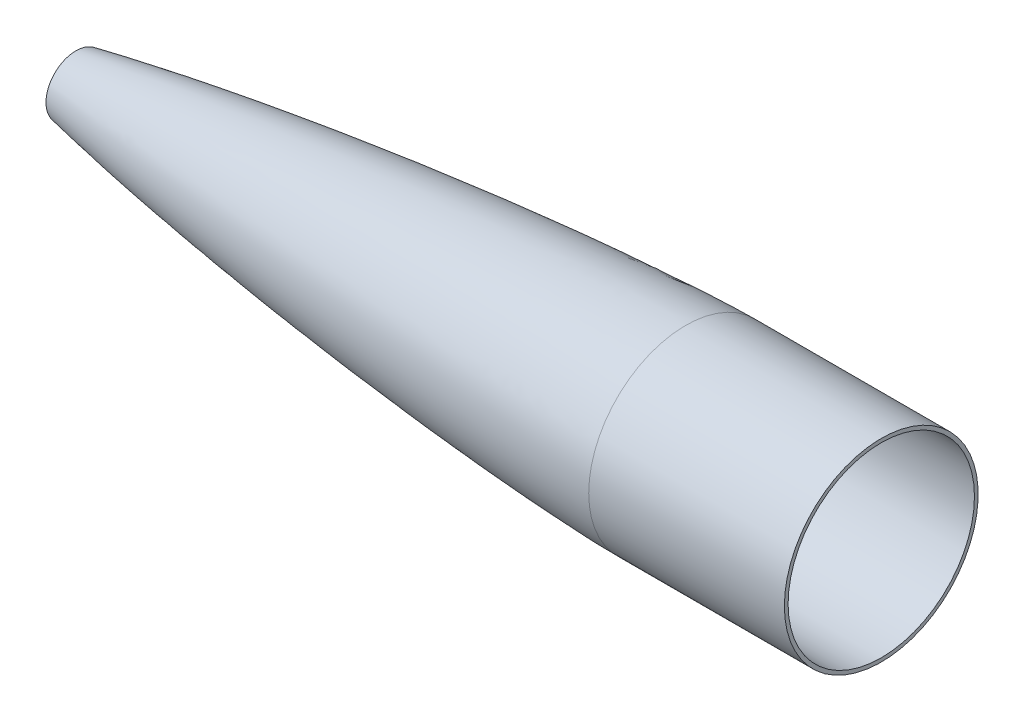
ISO-10303-21;
HEADER;
FILE_DESCRIPTION(('STEP AP214'),'2;1');
FILE_NAME('part.step','',(''),(''),'','','');
FILE_SCHEMA(('AUTOMOTIVE_DESIGN { 1 0 10303 214 1 1 1 1 }'));
ENDSEC;
DATA;
#1=APPLICATION_CONTEXT('core data for automotive mechanical design processes');
#2=APPLICATION_PROTOCOL_DEFINITION('international standard','automotive_design',2000,#1);
#3=PRODUCT_CONTEXT('',#1,'mechanical');
#4=PRODUCT('Part','Part','',(#3));
#5=PRODUCT_RELATED_PRODUCT_CATEGORY('part','',(#4));
#6=PRODUCT_DEFINITION_FORMATION('','',#4);
#7=PRODUCT_DEFINITION_CONTEXT('part definition',#1,'design');
#8=PRODUCT_DEFINITION('design','',#6,#7);
#9=PRODUCT_DEFINITION_SHAPE('','',#8);
#10=(LENGTH_UNIT() NAMED_UNIT(*) SI_UNIT(.MILLI.,.METRE.));
#11=(NAMED_UNIT(*) PLANE_ANGLE_UNIT() SI_UNIT($,.RADIAN.));
#12=(NAMED_UNIT(*) SI_UNIT($,.STERADIAN.) SOLID_ANGLE_UNIT());
#13=UNCERTAINTY_MEASURE_WITH_UNIT(LENGTH_MEASURE(1.E-05),#10,'distance_accuracy_value','');
#14=(GEOMETRIC_REPRESENTATION_CONTEXT(3) GLOBAL_UNCERTAINTY_ASSIGNED_CONTEXT((#13)) GLOBAL_UNIT_ASSIGNED_CONTEXT((#10,
#11,#12)) REPRESENTATION_CONTEXT('',''));
#15=CARTESIAN_POINT('',(0.,0.,0.));
#16=DIRECTION('',(0.,0.,1.));
#17=DIRECTION('',(1.,0.,0.));
#18=AXIS2_PLACEMENT_3D('',#15,#16,#17);
#19=CARTESIAN_POINT('',(-19.05,0.,0.));
#20=DIRECTION('',(-1.,0.,0.));
#21=DIRECTION('',(0.,0.,1.));
#22=AXIS2_PLACEMENT_3D('',#19,#20,#21);
#23=CYLINDRICAL_SURFACE('',#22,39.7256);
#24=CARTESIAN_POINT('',(294.4368,0.,0.));
#25=DIRECTION('',(-1.,0.,0.));
#26=DIRECTION('',(0.,0.,1.));
#27=AXIS2_PLACEMENT_3D('',#24,#25,#26);
#28=CIRCLE('',#27,39.7256);
#29=CARTESIAN_POINT('',(294.4368,0.,39.7256));
#30=VERTEX_POINT('',#29);
#31=EDGE_CURVE('E10',#30,#30,#28,.T.);
#32=ORIENTED_EDGE('',*,*,#31,.F.);
#33=EDGE_LOOP('',(#32));
#34=FACE_BOUND('',#33,.T.);
#35=CARTESIAN_POINT('',(374.650064344496,0.,0.));
#36=DIRECTION('',(-1.,0.,0.));
#37=DIRECTION('',(0.,0.,1.));
#38=AXIS2_PLACEMENT_3D('',#35,#36,#37);
#39=CIRCLE('',#38,39.7256);
#40=CARTESIAN_POINT('',(374.650064344496,0.,39.7256));
#41=VERTEX_POINT('',#40);
#42=EDGE_CURVE('E41',#41,#41,#39,.T.);
#43=ORIENTED_EDGE('',*,*,#42,.T.);
#44=EDGE_LOOP('',(#43));
#45=FACE_BOUND('',#44,.T.);
#46=ADVANCED_FACE('F34',(#34,#45),#23,.T.);
#47=CARTESIAN_POINT('',(294.4368,39.7256,0.));
#48=CARTESIAN_POINT('',(293.538264936894,39.7227781703544,0.));
#49=CARTESIAN_POINT('',(291.741303803302,39.7002039400171,0.));
#50=CARTESIAN_POINT('',(288.147806256193,39.6307016879067,0.));
#51=CARTESIAN_POINT('',(279.918815613173,39.3889822589623,0.));
#52=CARTESIAN_POINT('',(267.957235485054,38.8762226570791,0.));
#53=CARTESIAN_POINT('',(252.269921818901,37.9897310289716,0.));
#54=CARTESIAN_POINT('',(233.761451080803,36.6987300745286,0.));
#55=CARTESIAN_POINT('',(215.268686952188,35.200969595861,0.));
#56=CARTESIAN_POINT('',(196.792047007808,33.5162401971686,0.));
#57=CARTESIAN_POINT('',(178.332324198228,31.6557055301637,0.));
#58=CARTESIAN_POINT('',(159.890639304378,29.6240021598707,0.));
#59=CARTESIAN_POINT('',(141.468704528161,27.4205610926059,0.));
#60=CARTESIAN_POINT('',(123.068739671915,25.0400732746453,0.));
#61=CARTESIAN_POINT('',(104.694212708318,22.4706963349108,0.));
#62=CARTESIAN_POINT('',(86.3496826980187,19.6939502091708,0.));
#63=CARTESIAN_POINT('',(68.0430622365847,16.6772648540575,0.));
#64=CARTESIAN_POINT('',(49.818424698582,13.3765223021058,0.));
#65=CARTESIAN_POINT('',(33.9406856398122,10.1498634465492,0.));
#66=CARTESIAN_POINT('',(21.1447927754208,7.19091792425048,0.));
#67=CARTESIAN_POINT('',(12.0854389700209,4.74376046507185,0.));
#68=CARTESIAN_POINT('',(7.05576322628537,3.17959978307188,0.));
#69=CARTESIAN_POINT('',(4.0188012304067,2.08676764385367,0.));
#70=CARTESIAN_POINT('',(2.33371074508546,1.38731323839093,0.));
#71=CARTESIAN_POINT('',(1.40388432372297,0.947026682290267,0.));
#72=CARTESIAN_POINT('',(0.87209723308368,0.661946371557733,0.));
#73=CARTESIAN_POINT('',(0.556889445492457,0.472533954344698,0.));
#74=CARTESIAN_POINT('',(0.370605462423568,0.347964982562249,0.));
#75=CARTESIAN_POINT('',(0.248450567810074,0.257670761882754,0.));
#76=CARTESIAN_POINT('',(0.159992101765354,0.185526094257961,0.));
#77=CARTESIAN_POINT('',(0.0986367195289148,0.129934350685668,0.));
#78=CARTESIAN_POINT('',(0.0520006916757201,0.0813137653612726,0.));
#79=CARTESIAN_POINT('',(0.0201829235935841,0.0404052506099982,0.));
#80=CARTESIAN_POINT('',(0.00657570245071043,0.0182498433560136,0.));
#81=CARTESIAN_POINT('',(0.00185773297492475,0.0062340322543729,0.));
#82=CARTESIAN_POINT('',(0.,0.,0.));
#83=B_SPLINE_CURVE_WITH_KNOTS('',4,(#47,#48,#49,#50,#51,#52,#53,#54,#55,#56,#57,#58,#59,#60,#61,
#62,#63,#64,#65,#66,#67,#68,#69,#70,#71,#72,#73,#74,#75,#76,#77,#78,#79,#80,#81,#82),
.UNSPECIFIED.,.F.,.F.,(5,1,1,1,1,1,1,1,1,1,1,1,1,1,1,1,1,1,1,1,1,1,1,1,1,1,1,1,1,1,1,1,5),(0.,
0.0120599701125952,0.0241199402251903,0.0482398804503805,0.1104935820596,0.172747283844769,
0.235000984013769,0.297254686823773,0.359508386221387,0.421762088339113,0.484015788959948,
0.546269489090148,0.60852319021114,0.670776891466794,0.733030591698496,0.795284289783134,
0.857537990172938,0.919348906793277,0.95047573101264,0.971525230460581,0.983463902787434,
0.99002606304966,0.993781479893161,0.996003962640871,0.997267165840399,0.998121150964244,
0.998715599634537,0.999010469110389,0.999305338586241,0.99965266929312,0.99982633464656,
0.99991316732328,1.),.UNSPECIFIED.);
#84=CARTESIAN_POINT('',(-19.05,0.,0.));
#85=DIRECTION('',(-1.,0.,0.));
#86=AXIS1_PLACEMENT('',#84,#85);
#87=SURFACE_OF_REVOLUTION('',#83,#86);
#88=CARTESIAN_POINT('',(44.4500643444959,0.,0.));
#89=DIRECTION('',(-1.,0.,0.));
#90=DIRECTION('',(0.,0.,1.));
#91=AXIS2_PLACEMENT_3D('',#88,#89,#90);
#92=CIRCLE('',#91,12.2403045277828);
#93=CARTESIAN_POINT('',(44.4500643444959,0.,12.2403045277828));
#94=VERTEX_POINT('',#93);
#95=EDGE_CURVE('E153',#94,#94,#92,.F.);
#96=ORIENTED_EDGE('',*,*,#95,.T.);
#97=EDGE_LOOP('',(#96));
#98=FACE_BOUND('',#97,.T.);
#99=ORIENTED_EDGE('',*,*,#31,.T.);
#100=EDGE_LOOP('',(#99));
#101=FACE_BOUND('',#100,.T.);
#102=ADVANCED_FACE('F57',(#98,#101),#87,.T.);
#103=CARTESIAN_POINT('',(374.650064344496,0.,0.));
#104=DIRECTION('',(-1.,0.,0.));
#105=DIRECTION('',(0.,0.,1.));
#106=AXIS2_PLACEMENT_3D('',#103,#104,#105);
#107=PLANE('',#106);
#108=CARTESIAN_POINT('',(374.650064344496,0.,0.));
#109=DIRECTION('',(-1.,0.,0.));
#110=DIRECTION('',(0.,0.,1.));
#111=AXIS2_PLACEMENT_3D('',#108,#109,#110);
#112=CIRCLE('',#111,38.2016);
#113=CARTESIAN_POINT('',(374.650064344496,0.,38.2016));
#114=VERTEX_POINT('',#113);
#115=EDGE_CURVE('E52',#114,#114,#112,.T.);
#116=ORIENTED_EDGE('',*,*,#115,.T.);
#117=EDGE_LOOP('',(#116));
#118=FACE_BOUND('',#117,.T.);
#119=ORIENTED_EDGE('',*,*,#42,.F.);
#120=EDGE_LOOP('',(#119));
#121=FACE_BOUND('',#120,.T.);
#122=ADVANCED_FACE('F60',(#118,#121),#107,.F.);
#123=CARTESIAN_POINT('',(-19.05,0.,0.));
#124=DIRECTION('',(-1.,0.,0.));
#125=DIRECTION('',(0.,0.,1.));
#126=AXIS2_PLACEMENT_3D('',#123,#124,#125);
#127=CYLINDRICAL_SURFACE('',#126,38.2016);
#128=CARTESIAN_POINT('',(294.441586064899,0.,38.2016075152473));
#129=CARTESIAN_POINT('',(294.441586064891,-0.625072972520353,38.2016207745964));
#130=CARTESIAN_POINT('',(294.441586064892,-1.25014481680002,38.1862664038765));
#131=CARTESIAN_POINT('',(294.441586064899,-2.49878325596288,38.1249176080443));
#132=CARTESIAN_POINT('',(294.441586064904,-3.12234985084618,38.0789231829345));
#133=CARTESIAN_POINT('',(294.441586064905,-4.36647479842312,37.9563894840658));
#134=CARTESIAN_POINT('',(294.441586064901,-4.98703315111663,37.8798502103057));
#135=CARTESIAN_POINT('',(294.441586064898,-6.22364684018645,37.6964153836531));
#136=CARTESIAN_POINT('',(294.4415860649,-6.83970217656285,37.5895198307611));
#137=CARTESIAN_POINT('',(294.441586064906,-8.06582564670876,37.3456288466498));
#138=CARTESIAN_POINT('',(294.44158606491,-8.67589378047843,37.2086334154311));
#139=CARTESIAN_POINT('',(294.441586064911,-9.88857315263689,36.9048730087374));
#140=CARTESIAN_POINT('',(294.441586064908,-10.4911843910252,36.7381080332605));
#141=CARTESIAN_POINT('',(294.441586064903,-11.6874982251756,36.3752102090804));
#142=CARTESIAN_POINT('',(294.441586064901,-12.2812008209376,36.1790773603773));
#143=CARTESIAN_POINT('',(294.44158606489,-13.4582670893082,35.7579163125127));
#144=CARTESIAN_POINT('',(294.441586064881,-14.0416307619172,35.5328881133528));
#145=CARTESIAN_POINT('',(294.441586064886,-15.1966138095815,35.0544784714208));
#146=CARTESIAN_POINT('',(294.441586064899,-15.7682331846361,34.801097028647));
#147=CARTESIAN_POINT('',(294.44158606491,-16.8983505561088,34.2665913191246));
#148=CARTESIAN_POINT('',(294.441586064906,-17.4568485525265,33.9854670523749));
#149=CARTESIAN_POINT('',(294.441586064901,-18.559377696023,33.3961529475129));
#150=CARTESIAN_POINT('',(294.4415860649,-19.1034088431036,33.0879631094038));
#151=CARTESIAN_POINT('',(294.441586064901,-20.1756936693301,32.4452603182113));
#152=CARTESIAN_POINT('',(294.441586064904,-20.7039473484756,32.1107473651272));
#153=CARTESIAN_POINT('',(294.441586064905,-21.7434046294472,31.4162042149567));
#154=CARTESIAN_POINT('',(294.441586064904,-22.2546082312729,31.0561740178697));
#155=CARTESIAN_POINT('',(294.441586064905,-23.2587338233481,30.3114637239814));
#156=CARTESIAN_POINT('',(294.441586064907,-23.7516558135973,29.9267836271797));
#157=CARTESIAN_POINT('',(294.441586064905,-24.7180306902463,29.1337002619244));
#158=CARTESIAN_POINT('',(294.441586064902,-25.1914835766467,28.7252969934715));
#159=CARTESIAN_POINT('',(294.4415860649,-26.1177796561554,27.8857511641365));
#160=CARTESIAN_POINT('',(294.441586064901,-26.5706228492631,27.4546086032536));
#161=CARTESIAN_POINT('',(294.441586064902,-27.4546086032431,26.5706228492736));
#162=CARTESIAN_POINT('',(294.441586064904,-27.885751164116,26.117779656177));
#163=CARTESIAN_POINT('',(294.4415860649,-28.725296993452,25.1914835766693));
#164=CARTESIAN_POINT('',(294.441586064895,-29.1337002619148,24.7180306902578));
#165=CARTESIAN_POINT('',(294.441586064892,-29.9267836271488,23.751655813635));
#166=CARTESIAN_POINT('',(294.441586064893,-30.3114637239217,23.2587338234251));
#167=CARTESIAN_POINT('',(294.441586064897,-31.0561740178129,22.2546082313528));
#168=CARTESIAN_POINT('',(294.441586064899,-31.4162042149278,21.7434046294877));
#169=CARTESIAN_POINT('',(294.4415860649,-32.1107473651354,20.7039473484662));
#170=CARTESIAN_POINT('',(294.441586064898,-32.4452603182303,20.1756936693111));
#171=CARTESIAN_POINT('',(294.441586064894,-33.0879631094284,19.1034088430499));
#172=CARTESIAN_POINT('',(294.44158606489,-33.3961529475315,18.5593776959436));
#173=CARTESIAN_POINT('',(294.441586064886,-33.9854670524354,17.4568485524578));
#174=CARTESIAN_POINT('',(294.441586064885,-34.2665913192357,16.8983505560781));
#175=CARTESIAN_POINT('',(294.441586064892,-34.801097028535,15.7682331846684));
#176=CARTESIAN_POINT('',(294.441586064901,-35.0544784710353,15.1966138096391));
#177=CARTESIAN_POINT('',(294.441586064902,-35.5328881136757,14.041630762011));
#178=CARTESIAN_POINT('',(294.441586064895,-35.7579163138138,13.4582670894113));
#179=CARTESIAN_POINT('',(294.441586064897,-36.1790773590613,12.281200820876));
#180=CARTESIAN_POINT('',(294.441586064906,-36.3752102041712,11.6874982249406));
#181=CARTESIAN_POINT('',(294.441586064905,-36.7381080381535,10.4911843913137));
#182=CARTESIAN_POINT('',(294.441586064894,-36.9048730270277,9.88857315362268));
#183=CARTESIAN_POINT('',(294.441586064893,-37.2086333970878,8.67589377970386));
#184=CARTESIAN_POINT('',(294.441586064902,-37.3456287782738,8.06582564347604));
#185=CARTESIAN_POINT('',(294.441586064905,-37.5895198990956,6.83970218000428));
#186=CARTESIAN_POINT('',(294.441586064899,-37.6964156387287,6.22364685275981));
#187=CARTESIAN_POINT('',(294.441586064899,-37.8798499552237,4.98703313858579));
#188=CARTESIAN_POINT('',(294.441586064905,-37.9563885320872,4.36647475165647));
#189=CARTESIAN_POINT('',(294.441586064904,-38.0789241349129,3.12234989761487));
#190=CARTESIAN_POINT('',(294.441586064896,-38.1249211608762,2.49878343050271));
#191=CARTESIAN_POINT('',(294.441586064894,-38.1862628510446,1.25014464226043));
#192=CARTESIAN_POINT('',(294.441586064899,-38.2016075152473,0.625072321130206));
#193=CARTESIAN_POINT('',(294.441586064899,-38.2016075152473,-0.625072321130239));
#194=CARTESIAN_POINT('',(294.441586064894,-38.1862628510446,-1.25014464226046));
#195=CARTESIAN_POINT('',(294.441586064896,-38.1249211608762,-2.49878343050245));
#196=CARTESIAN_POINT('',(294.441586064904,-38.0789241349129,-3.12234989761433));
#197=CARTESIAN_POINT('',(294.441586064905,-37.9563885320831,-4.36647475169881));
#198=CARTESIAN_POINT('',(294.4415860649,-37.8798499552132,-4.98703313867107));
#199=CARTESIAN_POINT('',(294.441586064899,-37.6964156387202,-6.22364685280276));
#200=CARTESIAN_POINT('',(294.441586064903,-37.5895198991017,-6.83970217996289));
#201=CARTESIAN_POINT('',(294.441586064903,-37.3456287782929,-8.06582564339056));
#202=CARTESIAN_POINT('',(294.441586064897,-37.2086333970993,-8.67589377965746));
#203=CARTESIAN_POINT('',(294.44158606489,-36.9048730270299,-9.88857315361437));
#204=CARTESIAN_POINT('',(294.441586064888,-36.738108038156,-10.4911843913049));
#205=CARTESIAN_POINT('',(294.441586064889,-36.3752102041621,-11.6874982249709));
#206=CARTESIAN_POINT('',(294.441586064893,-36.1790773590385,-12.2812008209453));
#207=CARTESIAN_POINT('',(294.441586064898,-35.7579163138017,-13.4582670894398));
#208=CARTESIAN_POINT('',(294.441586064899,-35.5328881136937,-14.0416307619617));
#209=CARTESIAN_POINT('',(294.441586064901,-35.0544784710683,-15.1966138095652));
#210=CARTESIAN_POINT('',(294.441586064904,-34.8010970285467,-15.7682331846449));
#211=CARTESIAN_POINT('',(294.441586064905,-34.2665913192104,-16.8983505561304));
#212=CARTESIAN_POINT('',(294.441586064905,-33.9854670523958,-17.4568485525361));
#213=CARTESIAN_POINT('',(294.441586064902,-33.396152947493,-18.5593776960117));
#214=CARTESIAN_POINT('',(294.4415860649,-33.0879631094083,-19.1034088430834));
#215=CARTESIAN_POINT('',(294.441586064901,-32.4452603182429,-20.1756936692901));
#216=CARTESIAN_POINT('',(294.441586064903,-32.1107473651617,-20.7039473484247));
#217=CARTESIAN_POINT('',(294.441586064905,-31.4162042149759,-21.7434046294179));
#218=CARTESIAN_POINT('',(294.441586064905,-31.0561740178686,-22.2546082312748));
#219=CARTESIAN_POINT('',(294.441586064904,-30.3114637239656,-23.258733823369));
#220=CARTESIAN_POINT('',(294.441586064903,-29.9267836271714,-23.7516558136075));
#221=CARTESIAN_POINT('',(294.441586064898,-29.1337002619148,-24.7180306902578));
#222=CARTESIAN_POINT('',(294.441586064894,-28.725296993452,-25.1914835766693));
#223=CARTESIAN_POINT('',(294.441586064896,-27.8857511641265,-26.1177796561654));
#224=CARTESIAN_POINT('',(294.441586064902,-27.4546086032647,-26.5706228492509));
#225=CARTESIAN_POINT('',(294.441586064901,-26.5706228492858,-27.454608603232));
#226=CARTESIAN_POINT('',(294.441586064895,-26.117779656167,-27.885751164126));
#227=CARTESIAN_POINT('',(294.441586064895,-25.1914835766467,-28.7252969934715));
#228=CARTESIAN_POINT('',(294.441586064902,-24.7180306902463,-29.1337002619243));
#229=CARTESIAN_POINT('',(294.441586064899,-23.7516558136248,-29.9267836271572));
#230=CARTESIAN_POINT('',(294.441586064891,-23.2587338234043,-30.311463723938));
#231=CARTESIAN_POINT('',(294.441586064889,-22.2546082313311,-31.0561740178281));
#232=CARTESIAN_POINT('',(294.441586064896,-21.7434046294767,-31.4162042149351));
#233=CARTESIAN_POINT('',(294.441586064902,-20.7039473484662,-32.1107473651354));
#234=CARTESIAN_POINT('',(294.4415860649,-20.1756936693111,-32.4452603182303));
#235=CARTESIAN_POINT('',(294.441586064892,-19.1034088430499,-33.0879631094284));
#236=CARTESIAN_POINT('',(294.441586064885,-18.5593776959436,-33.3961529475315));
#237=CARTESIAN_POINT('',(294.44158606489,-17.4568485524662,-33.9854670524309));
#238=CARTESIAN_POINT('',(294.441586064902,-16.898350556095,-34.2665913192272));
#239=CARTESIAN_POINT('',(294.441586064907,-15.7682331846845,-34.801097028528));
#240=CARTESIAN_POINT('',(294.441586064899,-15.1966138096452,-35.0544784710328));
#241=CARTESIAN_POINT('',(294.441586064901,-14.0416307620475,-35.5328881136604));
#242=CARTESIAN_POINT('',(294.441586064911,-13.4582670894892,-35.7579163137838));
#243=CARTESIAN_POINT('',(294.441586064914,-12.2812008209633,-36.1790773590324));
#244=CARTESIAN_POINT('',(294.441586064907,-11.6874982249946,-36.3752102041545));
#245=CARTESIAN_POINT('',(294.441586064904,-10.491184391304,-36.7381080381568));
#246=CARTESIAN_POINT('',(294.441586064909,-9.88857315358276,-36.904873027039));
#247=CARTESIAN_POINT('',(294.44158606491,-8.67589377959438,-37.2086333971141));
#248=CARTESIAN_POINT('',(294.441586064907,-8.06582564332716,-37.3456287783066));
#249=CARTESIAN_POINT('',(294.4415860649,-6.83970217986199,-37.5895198991207));
#250=CARTESIAN_POINT('',(294.441586064898,-6.22364685266433,-37.6964156387437));
#251=CARTESIAN_POINT('',(294.4415860649,-4.98703313854245,-37.8798499552293));
#252=CARTESIAN_POINT('',(294.441586064905,-4.36647475161817,-37.9563885320916));
#253=CARTESIAN_POINT('',(294.441586064903,-3.12234989758717,-38.078924134915));
#254=CARTESIAN_POINT('',(294.441586064896,-2.49878343048059,-38.1249211608776));
#255=CARTESIAN_POINT('',(294.441586064894,-1.25014464224941,-38.1862628510449));
#256=CARTESIAN_POINT('',(294.441586064899,-0.625072321124702,-38.2016075152473));
#257=CARTESIAN_POINT('',(294.441586064899,0.625072321124707,-38.2016075152473));
#258=CARTESIAN_POINT('',(294.441586064894,1.25014464224941,-38.1862628510449));
#259=CARTESIAN_POINT('',(294.441586064896,2.49878343052469,-38.1249211608754));
#260=CARTESIAN_POINT('',(294.441586064903,3.12234989767528,-38.0789241349085));
#261=CARTESIAN_POINT('',(294.441586064905,4.36647475170504,-37.9563885320808));
#262=CARTESIAN_POINT('',(294.441586064901,4.98703313858451,-37.8798499552231));
#263=CARTESIAN_POINT('',(294.441586064898,6.22364685266272,-37.696415638744));
#264=CARTESIAN_POINT('',(294.4415860649,6.83970217986118,-37.5895198991208));
#265=CARTESIAN_POINT('',(294.441586064906,8.06582564336673,-37.3456287782987));
#266=CARTESIAN_POINT('',(294.441586064911,8.67589377967314,-37.2086333970964));
#267=CARTESIAN_POINT('',(294.44158606491,9.88857315365743,-36.9048730270182));
#268=CARTESIAN_POINT('',(294.441586064904,10.4911843913364,-36.7381080381468));
#269=CARTESIAN_POINT('',(294.441586064907,11.6874982249485,-36.3752102041686));
#270=CARTESIAN_POINT('',(294.441586064916,12.2812008208809,-36.1790773590597));
#271=CARTESIAN_POINT('',(294.441586064909,13.4582670894112,-35.7579163138139));
#272=CARTESIAN_POINT('',(294.441586064892,14.0416307620089,-35.5328881136764));
#273=CARTESIAN_POINT('',(294.441586064879,15.1966138096385,-35.0544784710356));
#274=CARTESIAN_POINT('',(294.441586064882,15.7682331846711,-34.8010970285339));
#275=CARTESIAN_POINT('',(294.441586064895,16.89835055607,-34.2665913192394));
#276=CARTESIAN_POINT('',(294.441586064903,17.4568485524362,-33.9854670524463));
#277=CARTESIAN_POINT('',(294.441586064904,18.5593776959376,-33.3961529475356));
#278=CARTESIAN_POINT('',(294.441586064896,19.1034088430718,-33.0879631094163));
#279=CARTESIAN_POINT('',(294.441586064896,20.1756936693328,-32.4452603182161));
#280=CARTESIAN_POINT('',(294.441586064904,20.7039473484612,-32.110747365138));
#281=CARTESIAN_POINT('',(294.441586064904,21.7434046294236,-31.4162042149714));
#282=CARTESIAN_POINT('',(294.441586064897,22.2546082312564,-31.0561740178812));
#283=CARTESIAN_POINT('',(294.441586064894,23.258733823333,-30.3114637239933));
#284=CARTESIAN_POINT('',(294.441586064899,23.7516558135768,-29.9267836271959));
#285=CARTESIAN_POINT('',(294.441586064902,24.7180306902308,-29.1337002619377));
#286=CARTESIAN_POINT('',(294.441586064901,25.1914835766409,-28.7252969934769));
#287=CARTESIAN_POINT('',(294.441586064902,26.117779656146,-27.8857511641449));
#288=CARTESIAN_POINT('',(294.441586064903,26.5706228492414,-27.4546086032742));
#289=CARTESIAN_POINT('',(294.4415860649,27.4546086032309,-26.5706228492869));
#290=CARTESIAN_POINT('',(294.441586064895,27.8857511641238,-26.1177796561693));
#291=CARTESIAN_POINT('',(294.441586064895,28.7252969934768,-25.1914835766409));
#292=CARTESIAN_POINT('',(294.441586064901,29.1337002619377,-24.7180306902308));
#293=CARTESIAN_POINT('',(294.4415860649,29.9267836271875,-23.751655813587));
#294=CARTESIAN_POINT('',(294.441586064894,30.3114637239771,-23.2587338233538));
#295=CARTESIAN_POINT('',(294.441586064896,31.056174017844,-22.2546082313076));
#296=CARTESIAN_POINT('',(294.441586064904,31.4162042149215,-21.7434046294949));
#297=CARTESIAN_POINT('',(294.441586064904,32.1107473651006,-20.7039473485204));
#298=CARTESIAN_POINT('',(294.441586064896,32.4452603182013,-20.175693669358));
#299=CARTESIAN_POINT('',(294.441586064896,33.0879631094147,-19.1034088430741));
#300=CARTESIAN_POINT('',(294.441586064905,33.3961529475271,-18.5593776959524));
#301=CARTESIAN_POINT('',(294.441586064902,33.9854670524324,-17.4568485524633));
#302=CARTESIAN_POINT('',(294.44158606489,34.2665913192263,-16.8983505560964));
#303=CARTESIAN_POINT('',(294.441586064887,34.8010970285401,-15.7682331846591));
#304=CARTESIAN_POINT('',(294.441586064895,35.0544784710583,-15.1966138095878));
#305=CARTESIAN_POINT('',(294.441586064908,35.5328881136956,-14.0416307619586));
#306=CARTESIAN_POINT('',(294.441586064912,35.7579163138168,-13.4582670894015));
#307=CARTESIAN_POINT('',(294.441586064913,36.1790773590637,-12.2812008208713));
#308=CARTESIAN_POINT('',(294.441586064911,36.375210204186,-11.6874982248969));
#309=CARTESIAN_POINT('',(294.4415860649,36.7381080381745,-10.4911843912398));
#310=CARTESIAN_POINT('',(294.441586064892,36.9048730270448,-9.88857315355823));
#311=CARTESIAN_POINT('',(294.441586064893,37.2086333971101,-8.67589377961121));
#312=CARTESIAN_POINT('',(294.441586064901,37.3456287783027,-8.06582564334513));
#313=CARTESIAN_POINT('',(294.441586064905,37.5895198991173,-6.83970217988037));
#314=CARTESIAN_POINT('',(294.441586064899,37.6964156387408,-6.22364685268197));
#315=CARTESIAN_POINT('',(294.4415860649,37.8798499552208,-4.98703313860173));
#316=CARTESIAN_POINT('',(294.441586064905,37.9563885320791,-4.36647475172013));
#317=CARTESIAN_POINT('',(294.441586064904,38.0789241349077,-3.12234989768589));
#318=CARTESIAN_POINT('',(294.441586064896,38.1249211608749,-2.49878343053296));
#319=CARTESIAN_POINT('',(294.441586064894,38.1862628510448,-1.25014464225335));
#320=CARTESIAN_POINT('',(294.441586064899,38.2016075152473,-0.625072321126677));
#321=CARTESIAN_POINT('',(294.441586064899,38.2016075152473,0.625072321126677));
#322=CARTESIAN_POINT('',(294.441586064894,38.1862628510448,1.25014464225336));
#323=CARTESIAN_POINT('',(294.441586064896,38.1249211608771,2.49878343048861));
#324=CARTESIAN_POINT('',(294.441586064904,38.0789241349142,3.1223498975973));
#325=CARTESIAN_POINT('',(294.441586064905,37.95638853209,4.36647475163196));
#326=CARTESIAN_POINT('',(294.4415860649,37.8798499552273,4.98703313855781));
#327=CARTESIAN_POINT('',(294.441586064899,37.6964156387408,6.22364685268198));
#328=CARTESIAN_POINT('',(294.441586064904,37.5895198991173,6.83970217988037));
#329=CARTESIAN_POINT('',(294.441586064902,37.3456287783022,8.06582564334775));
#330=CARTESIAN_POINT('',(294.441586064894,37.2086333971089,8.67589377961642));
#331=CARTESIAN_POINT('',(294.441586064893,36.9048730270323,9.88857315360768));
#332=CARTESIAN_POINT('',(294.4415860649,36.7381080381493,10.4911843913304));
#333=CARTESIAN_POINT('',(294.44158606491,36.3752102041573,11.6874982249837));
#334=CARTESIAN_POINT('',(294.441586064913,36.1790773590483,12.2812008209144));
#335=CARTESIAN_POINT('',(294.441586064912,35.7579163138167,13.4582670894016));
#336=CARTESIAN_POINT('',(294.441586064908,35.5328881136956,14.0416307619586));
#337=CARTESIAN_POINT('',(294.441586064895,35.0544784710583,15.1966138095878));
#338=CARTESIAN_POINT('',(294.441586064887,34.8010970285401,15.7682331846591));
#339=CARTESIAN_POINT('',(294.44158606489,34.2665913192263,16.8983505560964));
#340=CARTESIAN_POINT('',(294.441586064902,33.9854670524324,17.4568485524633));
#341=CARTESIAN_POINT('',(294.441586064905,33.3961529475271,18.5593776959524));
#342=CARTESIAN_POINT('',(294.441586064896,33.0879631094147,19.1034088430741));
#343=CARTESIAN_POINT('',(294.441586064896,32.4452603182013,20.175693669358));
#344=CARTESIAN_POINT('',(294.441586064906,32.1107473651006,20.7039473485204));
#345=CARTESIAN_POINT('',(294.441586064903,31.4162042149413,21.7434046294653));
#346=CARTESIAN_POINT('',(294.44158606489,31.056174017885,22.2546082312494));
#347=CARTESIAN_POINT('',(294.44158606489,30.3114637240209,23.2587338232976));
#348=CARTESIAN_POINT('',(294.441586064902,29.9267836272101,23.7516558135595));
#349=CARTESIAN_POINT('',(294.44158606491,29.1337002619367,24.718030690232));
#350=CARTESIAN_POINT('',(294.441586064906,28.7252969934749,25.1914835766432));
#351=CARTESIAN_POINT('',(294.441586064897,27.8857511641323,26.1177796561599));
#352=CARTESIAN_POINT('',(294.441586064893,27.4546086032514,26.5706228492652));
#353=CARTESIAN_POINT('',(294.441586064897,26.5706228492758,27.4546086032409));
#354=CARTESIAN_POINT('',(294.441586064906,26.1177796561815,27.8857511641117));
#355=CARTESIAN_POINT('',(294.441586064909,25.1914835766658,28.7252969934554));
#356=CARTESIAN_POINT('',(294.441586064905,24.7180306902436,29.1337002619273));
#357=CARTESIAN_POINT('',(294.441586064896,23.7516558135973,29.926783627179));
#358=CARTESIAN_POINT('',(294.441586064893,23.2587338233746,30.3114637239603));
#359=CARTESIAN_POINT('',(294.441586064897,22.2546082312996,31.0561740178512));
#360=CARTESIAN_POINT('',(294.441586064904,21.7434046294456,31.4162042149585));
#361=CARTESIAN_POINT('',(294.441586064904,20.7039473484611,32.1107473651362));
#362=CARTESIAN_POINT('',(294.441586064896,20.1756936693325,32.4452603182094));
#363=CARTESIAN_POINT('',(294.441586064896,19.1034088430722,33.0879631094231));
#364=CARTESIAN_POINT('',(294.441586064904,18.5593776959388,33.3961529475609));
#365=CARTESIAN_POINT('',(294.441586064903,17.456848552435,33.985467052421));
#366=CARTESIAN_POINT('',(294.441586064893,16.8983505560654,34.2665913191449));
#367=CARTESIAN_POINT('',(294.441586064892,15.7682331846834,34.8010970286247));
#368=CARTESIAN_POINT('',(294.441586064901,15.1966138096713,35.0544784713811));
#369=CARTESIAN_POINT('',(294.441586064902,14.0416307620108,35.5328881133166));
#370=CARTESIAN_POINT('',(294.441586064895,13.4582670893615,35.7579163124934));
#371=CARTESIAN_POINT('',(294.441586064897,12.2812008209586,36.17907736037));
#372=CARTESIAN_POINT('',(294.441586064906,11.6874982252054,36.3752102090707));
#373=CARTESIAN_POINT('',(294.441586064905,10.4911843910666,36.7381080332487));
#374=CARTESIAN_POINT('',(294.441586064894,9.88857315268098,36.9048730087255));
#375=CARTESIAN_POINT('',(294.441586064893,8.67589378048886,37.2086334154293));
#376=CARTESIAN_POINT('',(294.441586064901,8.06582564668234,37.3456288466561));
#377=CARTESIAN_POINT('',(294.441586064905,6.83970217654654,37.5895198307633));
#378=CARTESIAN_POINT('',(294.441586064899,6.22364684021794,37.6964153836471));
#379=CARTESIAN_POINT('',(294.441586064899,4.98703315120306,37.8798502102942));
#380=CARTESIAN_POINT('',(294.441586064905,4.36647479851641,37.956389484055));
#381=CARTESIAN_POINT('',(294.441586064904,3.12234985090755,38.0789231829301));
#382=CARTESIAN_POINT('',(294.441586064899,2.49878325598524,38.1249176080435));
#383=CARTESIAN_POINT('',(294.441586064892,1.25014481678885,38.1862664038767));
#384=CARTESIAN_POINT('',(294.441586064891,0.625072972514758,38.2016207745964));
#385=CARTESIAN_POINT('',(294.441586064899,0.,38.2016075152473));
#386=B_SPLINE_CURVE_WITH_KNOTS('',3,(#128,#129,#130,#131,#132,#133,#134,#135,#136,#137,#138,
#139,#140,#141,#142,#143,#144,#145,#146,#147,#148,#149,#150,#151,#152,#153,#154,#155,#156,#157,
#158,#159,#160,#161,#162,#163,#164,#165,#166,#167,#168,#169,#170,#171,#172,#173,#174,#175,#176,
#177,#178,#179,#180,#181,#182,#183,#184,#185,#186,#187,#188,#189,#190,#191,#192,#193,#194,#195,
#196,#197,#198,#199,#200,#201,#202,#203,#204,#205,#206,#207,#208,#209,#210,#211,#212,#213,#214,
#215,#216,#217,#218,#219,#220,#221,#222,#223,#224,#225,#226,#227,#228,#229,#230,#231,#232,#233,
#234,#235,#236,#237,#238,#239,#240,#241,#242,#243,#244,#245,#246,#247,#248,#249,#250,#251,#252,
#253,#254,#255,#256,#257,#258,#259,#260,#261,#262,#263,#264,#265,#266,#267,#268,#269,#270,#271,
#272,#273,#274,#275,#276,#277,#278,#279,#280,#281,#282,#283,#284,#285,#286,#287,#288,#289,#290,
#291,#292,#293,#294,#295,#296,#297,#298,#299,#300,#301,#302,#303,#304,#305,#306,#307,#308,#309,
#310,#311,#312,#313,#314,#315,#316,#317,#318,#319,#320,#321,#322,#323,#324,#325,#326,#327,#328,
#329,#330,#331,#332,#333,#334,#335,#336,#337,#338,#339,#340,#341,#342,#343,#344,#345,#346,#347,
#348,#349,#350,#351,#352,#353,#354,#355,#356,#357,#358,#359,#360,#361,#362,#363,#364,#365,#366,
#367,#368,#369,#370,#371,#372,#373,#374,#375,#376,#377,#378,#379,#380,#381,#382,#383,#384,#385),
.UNSPECIFIED.,.F.,.F.,(4,2,2,2,2,2,2,2,2,2,2,2,2,2,2,2,2,2,2,2,2,2,2,2,2,2,2,2,2,2,2,2,2,2,2,2,
2,2,2,2,2,2,2,2,2,2,2,2,2,2,2,2,2,2,2,2,2,2,2,2,2,2,2,2,2,2,2,2,2,2,2,2,2,2,2,2,2,2,2,2,2,2,2,2,
2,2,2,2,2,2,2,2,2,2,2,2,2,2,2,2,2,2,2,2,2,2,2,2,2,2,2,2,2,2,2,2,2,2,2,2,2,2,2,2,2,2,2,2,4),(0.,
1.87502876001169,3.75005751988151,5.62508627983225,7.50011503975336,9.37514379962932,
11.2501725596238,13.125201319618,15.0002300795156,16.8752588395297,18.7502875996144,
20.625316359469,22.500345119366,24.3753738793071,26.2504026392807,28.1254313991993,
30.0004601591772,31.8754889191104,33.7505176790736,35.6255464389008,37.5005751989884,
39.3756039589196,41.2506327188573,43.1256614788246,45.0006902387158,46.8757189987364,
48.7507477587209,50.625776518596,52.5008052784737,54.3758340385221,56.2508627984713,
58.1258915583429,60.0009203183544,61.8759490783659,63.7509778382367,65.6260065983158,
67.5010353581078,69.3760641181047,71.2510928779782,73.1261216380864,75.0011503978572,
76.8761791579125,78.7512079179688,80.6262366777891,82.5012654376467,84.3762941977011,
86.2513229576352,88.1263517175983,90.0013804774845,91.8764092375095,93.751437997428,
95.6264667572948,97.5014955173428,99.376524277274,101.251553037212,103.126581797151,
105.001610557075,106.876639316963,108.751668077054,110.626696837023,112.50172559702,
114.376754356925,116.251783116859,118.126811876714,120.001840636709,121.876869396704,
123.751898156691,125.62692691649,127.501955676397,129.376984436515,131.252013196354,
133.127041956329,135.002070716343,136.877099476245,138.752128236166,140.627156996201,
142.502185756038,144.377214516004,146.252243275957,148.127272035913,150.002300795839,
151.877329555859,153.752358315815,155.627387075728,157.502415835623,159.377444595583,
161.252473355574,163.127502115498,165.002530875526,166.87755963541,168.752588395517,
170.627617155361,172.502645915355,174.377674675263,176.252703435068,178.127732195062,
180.002760955063,181.877789715064,183.752818474925,185.627847234864,187.502875994771,
189.377904754773,191.252933514747,193.127962274717,195.0029910346,196.878019794628,
198.753048554552,200.628077314544,202.503106074503,204.378134834291,206.253163594311,
208.128192354272,210.00322111424,211.878249874164,213.75327863417,215.628307394043,
217.503336154089,219.378364913925,221.25339367396,223.128422433881,225.003451193758,
226.878479953786,228.753508713753,230.62853747374,232.503566233729,234.378594993505,
236.253623753435,238.128652513423,240.003681273418),.UNSPECIFIED.);
#387=CARTESIAN_POINT('',(294.441586064899,0.,38.2016075152473));
#388=VERTEX_POINT('',#387);
#389=EDGE_CURVE('E45',#388,#388,#386,.F.);
#390=ORIENTED_EDGE('',*,*,#389,.T.);
#391=EDGE_LOOP('',(#390));
#392=FACE_BOUND('',#391,.T.);
#393=ORIENTED_EDGE('',*,*,#115,.F.);
#394=EDGE_LOOP('',(#393));
#395=FACE_BOUND('',#394,.T.);
#396=ADVANCED_FACE('F64',(#392,#395),#127,.F.);
#397=CARTESIAN_POINT('',(294.4368,39.7256,0.));
#398=CARTESIAN_POINT('',(293.538264936894,39.7227781703544,0.));
#399=CARTESIAN_POINT('',(291.741303803302,39.7002039400171,0.));
#400=CARTESIAN_POINT('',(288.147806256193,39.6307016879067,0.));
#401=CARTESIAN_POINT('',(279.918815613173,39.3889822589623,0.));
#402=CARTESIAN_POINT('',(267.957235485054,38.8762226570791,0.));
#403=CARTESIAN_POINT('',(252.269921818901,37.9897310289716,0.));
#404=CARTESIAN_POINT('',(233.761451080803,36.6987300745286,0.));
#405=CARTESIAN_POINT('',(215.268686952188,35.200969595861,0.));
#406=CARTESIAN_POINT('',(196.792047007808,33.5162401971686,0.));
#407=CARTESIAN_POINT('',(178.332324198228,31.6557055301637,0.));
#408=CARTESIAN_POINT('',(159.890639304378,29.6240021598707,0.));
#409=CARTESIAN_POINT('',(141.468704528161,27.4205610926059,0.));
#410=CARTESIAN_POINT('',(123.068739671915,25.0400732746453,0.));
#411=CARTESIAN_POINT('',(104.694212708318,22.4706963349108,0.));
#412=CARTESIAN_POINT('',(86.3496826980187,19.6939502091708,0.));
#413=CARTESIAN_POINT('',(68.0430622365847,16.6772648540575,0.));
#414=CARTESIAN_POINT('',(49.818424698582,13.3765223021058,0.));
#415=CARTESIAN_POINT('',(33.9406856398122,10.1498634465492,0.));
#416=CARTESIAN_POINT('',(21.1447927754208,7.19091792425048,0.));
#417=CARTESIAN_POINT('',(12.0854389700209,4.74376046507185,0.));
#418=CARTESIAN_POINT('',(7.05576322628537,3.17959978307188,0.));
#419=CARTESIAN_POINT('',(4.23842460490553,2.16579776754358,0.));
#420=CARTESIAN_POINT('',(2.91844287915581,1.62831916428752,0.));
#421=CARTESIAN_POINT('',(2.42761451975086,1.41448505077096,0.));
#422=CARTESIAN_POINT('',(2.3850545342961,1.39583260023368,0.));
#423=B_SPLINE_CURVE_WITH_KNOTS('',4,(#397,#398,#399,#400,#401,#402,#403,#404,#405,#406,#407,
#408,#409,#410,#411,#412,#413,#414,#415,#416,#417,#418,#419,#420,#421,#422),.UNSPECIFIED.,.F.,
.F.,(5,1,1,1,1,1,1,1,1,1,1,1,1,1,1,1,1,1,1,1,1,1,5),(0.,0.0120599701125952,0.0241199402251903,
0.0482398804503805,0.1104935820596,0.172747283844769,0.235000984013769,0.297254686823773,
0.359508386221387,0.421762088339113,0.484015788959948,0.546269489090148,0.60852319021114,
0.670776891466794,0.733030591698496,0.795284289783134,0.857537990172938,0.919348906793277,
0.95047573101264,0.971525230460581,0.983463902787434,0.99002606304966,0.990649746694904),.UNSPECIFIED.);
#424=CARTESIAN_POINT('',(-19.05,0.,0.));
#425=DIRECTION('',(-1.,0.,0.));
#426=AXIS1_PLACEMENT('',#424,#425);
#427=SURFACE_OF_REVOLUTION('',#423,#426);
#428=OFFSET_SURFACE('',#427,-1.524,.F.);
#429=CARTESIAN_POINT('',(44.450064344496,0.,0.));
#430=DIRECTION('',(-1.,0.,0.));
#431=DIRECTION('',(0.,0.,1.));
#432=AXIS2_PLACEMENT_3D('',#429,#430,#431);
#433=CIRCLE('',#432,10.6861671444004);
#434=CARTESIAN_POINT('',(44.450064344496,0.,10.6861671444004));
#435=VERTEX_POINT('',#434);
#436=EDGE_CURVE('E37',#435,#435,#433,.F.);
#437=ORIENTED_EDGE('',*,*,#436,.F.);
#438=EDGE_LOOP('',(#437));
#439=FACE_BOUND('',#438,.T.);
#440=ORIENTED_EDGE('',*,*,#389,.F.);
#441=EDGE_LOOP('',(#440));
#442=FACE_BOUND('',#441,.T.);
#443=ADVANCED_FACE('F69',(#439,#442),#428,.F.);
#444=CARTESIAN_POINT('',(44.4500643444959,0.,0.));
#445=DIRECTION('',(1.,0.,0.));
#446=DIRECTION('',(0.,0.,-1.));
#447=AXIS2_PLACEMENT_3D('',#444,#445,#446);
#448=PLANE('',#447);
#449=ORIENTED_EDGE('',*,*,#436,.T.);
#450=EDGE_LOOP('',(#449));
#451=FACE_BOUND('',#450,.T.);
#452=ORIENTED_EDGE('',*,*,#95,.F.);
#453=EDGE_LOOP('',(#452));
#454=FACE_BOUND('',#453,.T.);
#455=ADVANCED_FACE('F103',(#451,#454),#448,.F.);
#456=CLOSED_SHELL('',(#46,#102,#122,#396,#443,#455));
#457=MANIFOLD_SOLID_BREP('B2',#456);
#458=ADVANCED_BREP_SHAPE_REPRESENTATION('',(#18,#457),#14);
#459=SHAPE_DEFINITION_REPRESENTATION(#9,#458);
ENDSEC;
END-ISO-10303-21;
